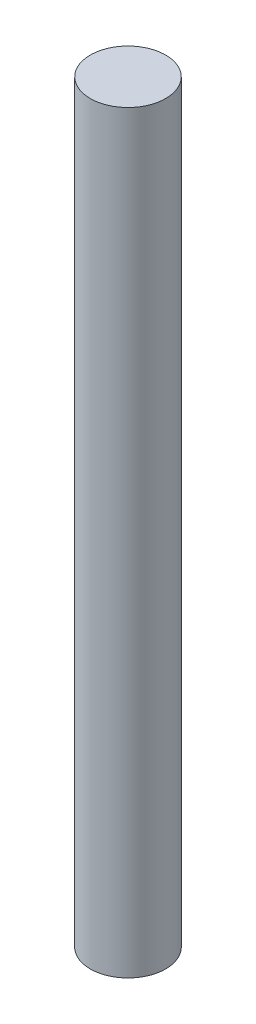
ISO-10303-21;
HEADER;
FILE_DESCRIPTION(('STEP AP214'),'2;1');
FILE_NAME('part.step','',(''),(''),'','','');
FILE_SCHEMA(('AUTOMOTIVE_DESIGN { 1 0 10303 214 1 1 1 1 }'));
ENDSEC;
DATA;
#1=APPLICATION_CONTEXT('core data for automotive mechanical design processes');
#2=APPLICATION_PROTOCOL_DEFINITION('international standard','automotive_design',2000,#1);
#3=PRODUCT_CONTEXT('',#1,'mechanical');
#4=PRODUCT('Part','Part','',(#3));
#5=PRODUCT_RELATED_PRODUCT_CATEGORY('part','',(#4));
#6=PRODUCT_DEFINITION_FORMATION('','',#4);
#7=PRODUCT_DEFINITION_CONTEXT('part definition',#1,'design');
#8=PRODUCT_DEFINITION('design','',#6,#7);
#9=PRODUCT_DEFINITION_SHAPE('','',#8);
#10=(LENGTH_UNIT() NAMED_UNIT(*) SI_UNIT(.MILLI.,.METRE.));
#11=(NAMED_UNIT(*) PLANE_ANGLE_UNIT() SI_UNIT($,.RADIAN.));
#12=(NAMED_UNIT(*) SI_UNIT($,.STERADIAN.) SOLID_ANGLE_UNIT());
#13=UNCERTAINTY_MEASURE_WITH_UNIT(LENGTH_MEASURE(1.E-05),#10,'distance_accuracy_value','');
#14=(GEOMETRIC_REPRESENTATION_CONTEXT(3) GLOBAL_UNCERTAINTY_ASSIGNED_CONTEXT((#13)) GLOBAL_UNIT_ASSIGNED_CONTEXT((#10,
#11,#12)) REPRESENTATION_CONTEXT('',''));
#15=CARTESIAN_POINT('',(0.,0.,0.));
#16=DIRECTION('',(0.,0.,1.));
#17=DIRECTION('',(1.,0.,0.));
#18=AXIS2_PLACEMENT_3D('',#15,#16,#17);
#19=CARTESIAN_POINT('',(0.,600.,0.));
#20=DIRECTION('',(0.,-1.,0.));
#21=DIRECTION('',(0.,0.,-1.));
#22=AXIS2_PLACEMENT_3D('',#19,#20,#21);
#23=CYLINDRICAL_SURFACE('',#22,30.);
#24=CARTESIAN_POINT('',(0.,600.,0.));
#25=DIRECTION('',(0.,1.,0.));
#26=DIRECTION('',(0.,0.,1.));
#27=AXIS2_PLACEMENT_3D('',#24,#25,#26);
#28=CIRCLE('',#27,30.);
#29=CARTESIAN_POINT('',(0.,600.,30.));
#30=VERTEX_POINT('',#29);
#31=EDGE_CURVE('E10',#30,#30,#28,.T.);
#32=ORIENTED_EDGE('',*,*,#31,.F.);
#33=EDGE_LOOP('',(#32));
#34=FACE_BOUND('',#33,.T.);
#35=CARTESIAN_POINT('',(0.,0.,0.));
#36=DIRECTION('',(0.,1.,0.));
#37=DIRECTION('',(0.,0.,1.));
#38=AXIS2_PLACEMENT_3D('',#35,#36,#37);
#39=CIRCLE('',#38,30.);
#40=CARTESIAN_POINT('',(0.,0.,30.));
#41=VERTEX_POINT('',#40);
#42=EDGE_CURVE('E40',#41,#41,#39,.T.);
#43=ORIENTED_EDGE('',*,*,#42,.T.);
#44=EDGE_LOOP('',(#43));
#45=FACE_BOUND('',#44,.T.);
#46=ADVANCED_FACE('F37',(#34,#45),#23,.T.);
#47=CARTESIAN_POINT('',(0.,600.,0.));
#48=DIRECTION('',(0.,1.,0.));
#49=DIRECTION('',(0.,0.,1.));
#50=AXIS2_PLACEMENT_3D('',#47,#48,#49);
#51=PLANE('',#50);
#52=ORIENTED_EDGE('',*,*,#31,.T.);
#53=EDGE_LOOP('',(#52));
#54=FACE_BOUND('',#53,.T.);
#55=ADVANCED_FACE('F52',(#54),#51,.T.);
#56=CARTESIAN_POINT('',(0.,0.,0.));
#57=DIRECTION('',(0.,1.,0.));
#58=DIRECTION('',(0.,0.,1.));
#59=AXIS2_PLACEMENT_3D('',#56,#57,#58);
#60=PLANE('',#59);
#61=ORIENTED_EDGE('',*,*,#42,.F.);
#62=EDGE_LOOP('',(#61));
#63=FACE_BOUND('',#62,.T.);
#64=ADVANCED_FACE('F50',(#63),#60,.F.);
#65=CLOSED_SHELL('',(#46,#55,#64));
#66=MANIFOLD_SOLID_BREP('B2',#65);
#67=ADVANCED_BREP_SHAPE_REPRESENTATION('',(#18,#66),#14);
#68=SHAPE_DEFINITION_REPRESENTATION(#9,#67);
ENDSEC;
END-ISO-10303-21;
